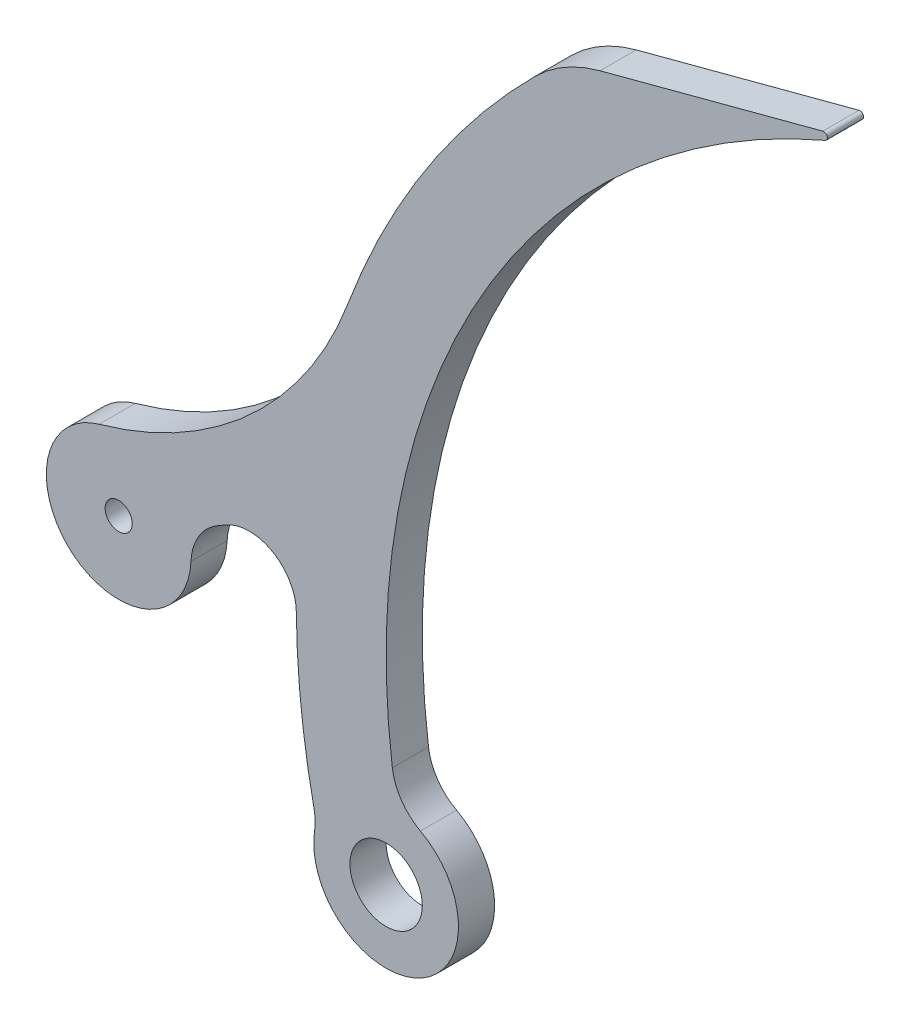
ISO-10303-21;
HEADER;
FILE_DESCRIPTION(('STEP AP214'),'2;1');
FILE_NAME('part.step','',(''),(''),'','','');
FILE_SCHEMA(('AUTOMOTIVE_DESIGN { 1 0 10303 214 1 1 1 1 }'));
ENDSEC;
DATA;
#1=APPLICATION_CONTEXT('core data for automotive mechanical design processes');
#2=APPLICATION_PROTOCOL_DEFINITION('international standard','automotive_design',2000,#1);
#3=PRODUCT_CONTEXT('',#1,'mechanical');
#4=PRODUCT('Part','Part','',(#3));
#5=PRODUCT_RELATED_PRODUCT_CATEGORY('part','',(#4));
#6=PRODUCT_DEFINITION_FORMATION('','',#4);
#7=PRODUCT_DEFINITION_CONTEXT('part definition',#1,'design');
#8=PRODUCT_DEFINITION('design','',#6,#7);
#9=PRODUCT_DEFINITION_SHAPE('','',#8);
#10=(LENGTH_UNIT() NAMED_UNIT(*) SI_UNIT(.MILLI.,.METRE.));
#11=(NAMED_UNIT(*) PLANE_ANGLE_UNIT() SI_UNIT($,.RADIAN.));
#12=(NAMED_UNIT(*) SI_UNIT($,.STERADIAN.) SOLID_ANGLE_UNIT());
#13=UNCERTAINTY_MEASURE_WITH_UNIT(LENGTH_MEASURE(1.E-05),#10,'distance_accuracy_value','');
#14=(GEOMETRIC_REPRESENTATION_CONTEXT(3) GLOBAL_UNCERTAINTY_ASSIGNED_CONTEXT((#13)) GLOBAL_UNIT_ASSIGNED_CONTEXT((#10,
#11,#12)) REPRESENTATION_CONTEXT('',''));
#15=CARTESIAN_POINT('',(0.,0.,0.));
#16=DIRECTION('',(0.,0.,1.));
#17=DIRECTION('',(1.,0.,0.));
#18=AXIS2_PLACEMENT_3D('',#15,#16,#17);
#19=CARTESIAN_POINT('',(-109.260328759457,258.812898886202,12.7));
#20=DIRECTION('',(0.,0.,-1.));
#21=DIRECTION('',(-1.,0.,0.));
#22=AXIS2_PLACEMENT_3D('',#19,#20,#21);
#23=PLANE('',#22);
#24=CARTESIAN_POINT('',(-262.922494984712,-45.7605384041366,12.7));
#25=DIRECTION('',(0.,0.,1.));
#26=DIRECTION('',(1.,0.,0.));
#27=AXIS2_PLACEMENT_3D('',#24,#25,#26);
#28=CIRCLE('',#27,12.7);
#29=CARTESIAN_POINT('',(-250.222494984712,-45.7605384041366,12.7));
#30=VERTEX_POINT('',#29);
#31=EDGE_CURVE('E172',#30,#30,#28,.T.);
#32=ORIENTED_EDGE('',*,*,#31,.F.);
#33=EDGE_LOOP('',(#32));
#34=FACE_BOUND('',#33,.T.);
#35=CARTESIAN_POINT('',(-109.260328759457,258.812898886202,12.7));
#36=DIRECTION('',(0.,0.,1.));
#37=DIRECTION('',(-1.,0.,0.));
#38=AXIS2_PLACEMENT_3D('',#35,#36,#37);
#39=CIRCLE('',#38,1.26999999999998);
#40=CARTESIAN_POINT('',(-108.761135556598,257.645120591225,12.7));
#41=VERTEX_POINT('',#40);
#42=CARTESIAN_POINT('',(-109.585986317079,260.040435914224,12.7));
#43=VERTEX_POINT('',#42);
#44=EDGE_CURVE('E195',#41,#43,#39,.T.);
#45=ORIENTED_EDGE('',*,*,#44,.T.);
#46=DIRECTION('',(-0.966564588993376,-0.256423273717627,0.));
#47=VECTOR('',#46,1.);
#48=CARTESIAN_POINT('',(-187.814837627455,239.286832502095,12.7));
#49=LINE('',#48,#47);
#50=CARTESIAN_POINT('',(-187.814837627455,239.286832502095,12.7));
#51=VERTEX_POINT('',#50);
#52=EDGE_CURVE('E113',#43,#51,#49,.T.);
#53=ORIENTED_EDGE('',*,*,#52,.T.);
#54=CARTESIAN_POINT('',(-174.788535322599,190.185351381231,12.7));
#55=DIRECTION('',(0.,0.,1.));
#56=DIRECTION('',(-1.,0.,0.));
#57=AXIS2_PLACEMENT_3D('',#54,#55,#56);
#58=CIRCLE('',#57,50.8000000000001);
#59=CARTESIAN_POINT('',(-210.684679592418,226.131238858944,12.7));
#60=VERTEX_POINT('',#59);
#61=EDGE_CURVE('E228',#51,#60,#58,.T.);
#62=ORIENTED_EDGE('',*,*,#61,.T.);
#63=CARTESIAN_POINT('',(-8.92249498471215,24.0894615958634,12.7));
#64=DIRECTION('',(0.,0.,1.));
#65=DIRECTION('',(1.,0.,0.));
#66=AXIS2_PLACEMENT_3D('',#63,#64,#65);
#67=CIRCLE('',#66,285.532588152908);
#68=CARTESIAN_POINT('',(-276.366612209981,124.101976107272,12.7));
#69=VERTEX_POINT('',#68);
#70=EDGE_CURVE('E247',#60,#69,#67,.T.);
#71=ORIENTED_EDGE('',*,*,#70,.T.);
#72=CARTESIAN_POINT('',(-399.008691384775,169.964801023502,12.7));
#73=DIRECTION('',(0.,0.,-1.));
#74=DIRECTION('',(1.,0.,0.));
#75=AXIS2_PLACEMENT_3D('',#72,#73,#74);
#76=CIRCLE('',#75,130.936924866949);
#77=CARTESIAN_POINT('',(-363.664476837649,43.8883766148923,12.7));
#78=VERTEX_POINT('',#77);
#79=EDGE_CURVE('E244',#69,#78,#76,.T.);
#80=ORIENTED_EDGE('',*,*,#79,.T.);
#81=CARTESIAN_POINT('',(-356.808175222125,19.4312482438643,12.7));
#82=DIRECTION('',(0.,0.,1.));
#83=DIRECTION('',(1.,0.,0.));
#84=AXIS2_PLACEMENT_3D('',#81,#82,#83);
#85=CIRCLE('',#84,25.4);
#86=CARTESIAN_POINT('',(-331.433346202008,18.3007385358963,12.7));
#87=VERTEX_POINT('',#86);
#88=EDGE_CURVE('E246',#78,#87,#85,.T.);
#89=ORIENTED_EDGE('',*,*,#88,.T.);
#90=CARTESIAN_POINT('',(-312.402224436919,17.4528562549199,12.7));
#91=DIRECTION('',(0.,0.,-1.));
#92=DIRECTION('',(1.,0.,0.));
#93=AXIS2_PLACEMENT_3D('',#90,#91,#92);
#94=CIRCLE('',#93,19.0500000000008);
#95=CARTESIAN_POINT('',(-321.809158258288,34.0182447526406,12.7));
#96=VERTEX_POINT('',#95);
#97=EDGE_CURVE('E249',#87,#96,#94,.T.);
#98=ORIENTED_EDGE('',*,*,#97,.T.);
#99=CARTESIAN_POINT('',(-399.008691384775,169.964801023502,12.7));
#100=DIRECTION('',(0.,0.,1.));
#101=DIRECTION('',(1.,0.,0.));
#102=AXIS2_PLACEMENT_3D('',#99,#100,#101);
#103=CIRCLE('',#102,156.336924866949);
#104=CARTESIAN_POINT('',(-319.362594724367,35.4369847042924,12.7));
#105=VERTEX_POINT('',#104);
#106=EDGE_CURVE('E255',#96,#105,#103,.T.);
#107=ORIENTED_EDGE('',*,*,#106,.T.);
#108=CARTESIAN_POINT('',(-310.951548792752,21.2301410598975,12.7));
#109=DIRECTION('',(0.,0.,-1.));
#110=DIRECTION('',(1.,0.,0.));
#111=AXIS2_PLACEMENT_3D('',#108,#109,#110);
#112=CIRCLE('',#111,16.5100000000003);
#113=CARTESIAN_POINT('',(-294.442288595821,21.3864348538876,12.7));
#114=VERTEX_POINT('',#113);
#115=EDGE_CURVE('E257',#105,#114,#112,.T.);
#116=ORIENTED_EDGE('',*,*,#115,.T.);
#117=CARTESIAN_POINT('',(-8.92249498471215,24.0894615958634,12.7));
#118=DIRECTION('',(0.,0.,1.));
#119=DIRECTION('',(1.,0.,0.));
#120=AXIS2_PLACEMENT_3D('',#117,#118,#119);
#121=CIRCLE('',#120,285.532588152908);
#122=CARTESIAN_POINT('',(-288.238569153544,-35.1675178091794,12.7));
#123=VERTEX_POINT('',#122);
#124=EDGE_CURVE('E259',#114,#123,#121,.T.);
#125=ORIENTED_EDGE('',*,*,#124,.T.);
#126=CARTESIAN_POINT('',(-306.873819327043,-39.1209910885999,12.7));
#127=DIRECTION('',(0.,0.,-1.));
#128=DIRECTION('',(1.,0.,0.));
#129=AXIS2_PLACEMENT_3D('',#126,#127,#128);
#130=CIRCLE('',#129,19.0499999999997);
#131=CARTESIAN_POINT('',(-288.037537466045,-41.9665113666863,12.7));
#132=VERTEX_POINT('',#131);
#133=EDGE_CURVE('E150',#123,#132,#130,.T.);
#134=ORIENTED_EDGE('',*,*,#133,.T.);
#135=CARTESIAN_POINT('',(-262.922494984712,-45.7605384041366,12.7));
#136=DIRECTION('',(0.,0.,1.));
#137=DIRECTION('',(1.,0.,0.));
#138=AXIS2_PLACEMENT_3D('',#135,#136,#137);
#139=CIRCLE('',#138,25.4000000000006);
#140=CARTESIAN_POINT('',(-250.885068445253,-23.3940375086647,12.7));
#141=VERTEX_POINT('',#140);
#142=EDGE_CURVE('E144',#132,#141,#139,.T.);
#143=ORIENTED_EDGE('',*,*,#142,.T.);
#144=CARTESIAN_POINT('',(-241.856998540658,-6.61916183706124,12.7));
#145=DIRECTION('',(0.,0.,-1.));
#146=DIRECTION('',(-1.,0.,0.));
#147=AXIS2_PLACEMENT_3D('',#144,#145,#146);
#148=CIRCLE('',#147,19.0500000000003);
#149=CARTESIAN_POINT('',(-260.743579910059,-9.10905022351537,12.7));
#150=VERTEX_POINT('',#149);
#151=EDGE_CURVE('E148',#141,#150,#148,.T.);
#152=ORIENTED_EDGE('',*,*,#151,.T.);
#153=CARTESIAN_POINT('',(-8.92249498471215,24.0894615958634,12.7));
#154=DIRECTION('',(0.,0.,-1.));
#155=DIRECTION('',(1.,0.,0.));
#156=AXIS2_PLACEMENT_3D('',#153,#154,#155);
#157=CIRCLE('',#156,254.);
#158=EDGE_CURVE('E52',#150,#41,#157,.T.);
#159=ORIENTED_EDGE('',*,*,#158,.T.);
#160=EDGE_LOOP('',(#45,#53,#62,#71,#80,#89,#98,#107,#116,#125,#134,#143,#152,#159));
#161=FACE_BOUND('',#160,.T.);
#162=CARTESIAN_POINT('',(-356.808175222125,19.4312482438643,12.7));
#163=DIRECTION('',(0.,0.,1.));
#164=DIRECTION('',(1.,0.,0.));
#165=AXIS2_PLACEMENT_3D('',#162,#163,#164);
#166=CIRCLE('',#165,4.76250000000001);
#167=CARTESIAN_POINT('',(-352.045675222125,19.4312482438643,12.7));
#168=VERTEX_POINT('',#167);
#169=EDGE_CURVE('E302',#168,#168,#166,.T.);
#170=ORIENTED_EDGE('',*,*,#169,.F.);
#171=EDGE_LOOP('',(#170));
#172=FACE_BOUND('',#171,.T.);
#173=ADVANCED_FACE('F35',(#34,#161,#172),#23,.F.);
#174=CARTESIAN_POINT('',(-109.260328759457,258.812898886202,0.));
#175=DIRECTION('',(0.,0.,-1.));
#176=DIRECTION('',(-1.,0.,0.));
#177=AXIS2_PLACEMENT_3D('',#174,#175,#176);
#178=PLANE('',#177);
#179=CARTESIAN_POINT('',(-262.922494984712,-45.7605384041366,0.));
#180=DIRECTION('',(0.,0.,1.));
#181=DIRECTION('',(1.,0.,0.));
#182=AXIS2_PLACEMENT_3D('',#179,#180,#181);
#183=CIRCLE('',#182,12.7);
#184=CARTESIAN_POINT('',(-250.222494984712,-45.7605384041366,0.));
#185=VERTEX_POINT('',#184);
#186=EDGE_CURVE('E307',#185,#185,#183,.T.);
#187=ORIENTED_EDGE('',*,*,#186,.T.);
#188=EDGE_LOOP('',(#187));
#189=FACE_BOUND('',#188,.T.);
#190=CARTESIAN_POINT('',(-109.260328759457,258.812898886202,0.));
#191=DIRECTION('',(0.,0.,1.));
#192=DIRECTION('',(-1.,0.,0.));
#193=AXIS2_PLACEMENT_3D('',#190,#191,#192);
#194=CIRCLE('',#193,1.26999999999998);
#195=CARTESIAN_POINT('',(-108.761135556598,257.645120591225,0.));
#196=VERTEX_POINT('',#195);
#197=CARTESIAN_POINT('',(-109.585986317079,260.040435914224,0.));
#198=VERTEX_POINT('',#197);
#199=EDGE_CURVE('E168',#196,#198,#194,.T.);
#200=ORIENTED_EDGE('',*,*,#199,.F.);
#201=CARTESIAN_POINT('',(-8.92249498471215,24.0894615958634,0.));
#202=DIRECTION('',(0.,0.,-1.));
#203=DIRECTION('',(1.,0.,0.));
#204=AXIS2_PLACEMENT_3D('',#201,#202,#203);
#205=CIRCLE('',#204,254.);
#206=CARTESIAN_POINT('',(-260.743579910059,-9.10905022351537,0.));
#207=VERTEX_POINT('',#206);
#208=EDGE_CURVE('E105',#207,#196,#205,.T.);
#209=ORIENTED_EDGE('',*,*,#208,.F.);
#210=CARTESIAN_POINT('',(-241.856998540658,-6.61916183706124,0.));
#211=DIRECTION('',(0.,0.,-1.));
#212=DIRECTION('',(-1.,0.,0.));
#213=AXIS2_PLACEMENT_3D('',#210,#211,#212);
#214=CIRCLE('',#213,19.0500000000003);
#215=CARTESIAN_POINT('',(-250.885068445253,-23.3940375086647,0.));
#216=VERTEX_POINT('',#215);
#217=EDGE_CURVE('E99',#216,#207,#214,.T.);
#218=ORIENTED_EDGE('',*,*,#217,.F.);
#219=CARTESIAN_POINT('',(-262.922494984712,-45.7605384041366,0.));
#220=DIRECTION('',(0.,0.,1.));
#221=DIRECTION('',(1.,0.,0.));
#222=AXIS2_PLACEMENT_3D('',#219,#220,#221);
#223=CIRCLE('',#222,25.4000000000006);
#224=CARTESIAN_POINT('',(-288.037537466045,-41.9665113666863,0.));
#225=VERTEX_POINT('',#224);
#226=EDGE_CURVE('E158',#225,#216,#223,.T.);
#227=ORIENTED_EDGE('',*,*,#226,.F.);
#228=CARTESIAN_POINT('',(-306.873819327043,-39.1209910885999,0.));
#229=DIRECTION('',(0.,0.,-1.));
#230=DIRECTION('',(1.,0.,0.));
#231=AXIS2_PLACEMENT_3D('',#228,#229,#230);
#232=CIRCLE('',#231,19.0499999999997);
#233=CARTESIAN_POINT('',(-288.238569153544,-35.1675178091794,0.));
#234=VERTEX_POINT('',#233);
#235=EDGE_CURVE('E190',#234,#225,#232,.T.);
#236=ORIENTED_EDGE('',*,*,#235,.F.);
#237=CARTESIAN_POINT('',(-8.92249498471215,24.0894615958634,0.));
#238=DIRECTION('',(0.,0.,1.));
#239=DIRECTION('',(1.,0.,0.));
#240=AXIS2_PLACEMENT_3D('',#237,#238,#239);
#241=CIRCLE('',#240,285.532588152908);
#242=CARTESIAN_POINT('',(-294.442288595821,21.3864348538876,0.));
#243=VERTEX_POINT('',#242);
#244=EDGE_CURVE('E188',#243,#234,#241,.T.);
#245=ORIENTED_EDGE('',*,*,#244,.F.);
#246=CARTESIAN_POINT('',(-310.951548792752,21.2301410598975,0.));
#247=DIRECTION('',(0.,0.,-1.));
#248=DIRECTION('',(1.,0.,0.));
#249=AXIS2_PLACEMENT_3D('',#246,#247,#248);
#250=CIRCLE('',#249,16.5100000000003);
#251=CARTESIAN_POINT('',(-319.362594724367,35.4369847042924,0.));
#252=VERTEX_POINT('',#251);
#253=EDGE_CURVE('E186',#252,#243,#250,.T.);
#254=ORIENTED_EDGE('',*,*,#253,.F.);
#255=CARTESIAN_POINT('',(-399.008691384775,169.964801023502,0.));
#256=DIRECTION('',(0.,0.,1.));
#257=DIRECTION('',(1.,0.,0.));
#258=AXIS2_PLACEMENT_3D('',#255,#256,#257);
#259=CIRCLE('',#258,156.336924866949);
#260=CARTESIAN_POINT('',(-321.809158258288,34.0182447526406,0.));
#261=VERTEX_POINT('',#260);
#262=EDGE_CURVE('E184',#261,#252,#259,.T.);
#263=ORIENTED_EDGE('',*,*,#262,.F.);
#264=CARTESIAN_POINT('',(-312.402224436919,17.4528562549199,0.));
#265=DIRECTION('',(0.,0.,-1.));
#266=DIRECTION('',(1.,0.,0.));
#267=AXIS2_PLACEMENT_3D('',#264,#265,#266);
#268=CIRCLE('',#267,19.0500000000008);
#269=CARTESIAN_POINT('',(-331.433346202008,18.3007385358963,0.));
#270=VERTEX_POINT('',#269);
#271=EDGE_CURVE('E182',#270,#261,#268,.T.);
#272=ORIENTED_EDGE('',*,*,#271,.F.);
#273=CARTESIAN_POINT('',(-356.808175222125,19.4312482438643,0.));
#274=DIRECTION('',(0.,0.,1.));
#275=DIRECTION('',(1.,0.,0.));
#276=AXIS2_PLACEMENT_3D('',#273,#274,#275);
#277=CIRCLE('',#276,25.4);
#278=CARTESIAN_POINT('',(-363.664476837649,43.8883766148923,0.));
#279=VERTEX_POINT('',#278);
#280=EDGE_CURVE('E180',#279,#270,#277,.T.);
#281=ORIENTED_EDGE('',*,*,#280,.F.);
#282=CARTESIAN_POINT('',(-399.008691384775,169.964801023502,0.));
#283=DIRECTION('',(0.,0.,-1.));
#284=DIRECTION('',(1.,0.,0.));
#285=AXIS2_PLACEMENT_3D('',#282,#283,#284);
#286=CIRCLE('',#285,130.936924866949);
#287=CARTESIAN_POINT('',(-276.366612209981,124.101976107272,0.));
#288=VERTEX_POINT('',#287);
#289=EDGE_CURVE('E178',#288,#279,#286,.T.);
#290=ORIENTED_EDGE('',*,*,#289,.F.);
#291=CARTESIAN_POINT('',(-8.92249498471215,24.0894615958634,0.));
#292=DIRECTION('',(0.,0.,1.));
#293=DIRECTION('',(1.,0.,0.));
#294=AXIS2_PLACEMENT_3D('',#291,#292,#293);
#295=CIRCLE('',#294,285.532588152908);
#296=CARTESIAN_POINT('',(-210.684679592418,226.131238858944,0.));
#297=VERTEX_POINT('',#296);
#298=EDGE_CURVE('E176',#297,#288,#295,.T.);
#299=ORIENTED_EDGE('',*,*,#298,.F.);
#300=CARTESIAN_POINT('',(-174.788535322599,190.185351381231,0.));
#301=DIRECTION('',(0.,0.,1.));
#302=DIRECTION('',(-1.,0.,0.));
#303=AXIS2_PLACEMENT_3D('',#300,#301,#302);
#304=CIRCLE('',#303,50.8000000000001);
#305=CARTESIAN_POINT('',(-187.814837627455,239.286832502095,0.));
#306=VERTEX_POINT('',#305);
#307=EDGE_CURVE('E174',#306,#297,#304,.T.);
#308=ORIENTED_EDGE('',*,*,#307,.F.);
#309=DIRECTION('',(-0.966564588993376,-0.256423273717627,0.));
#310=VECTOR('',#309,1.);
#311=CARTESIAN_POINT('',(-187.814837627455,239.286832502095,0.));
#312=LINE('',#311,#310);
#313=EDGE_CURVE('E171',#198,#306,#312,.T.);
#314=ORIENTED_EDGE('',*,*,#313,.F.);
#315=EDGE_LOOP('',(#200,#209,#218,#227,#236,#245,#254,#263,#272,#281,#290,#299,#308,#314));
#316=FACE_BOUND('',#315,.T.);
#317=CARTESIAN_POINT('',(-356.808175222125,19.4312482438643,0.));
#318=DIRECTION('',(0.,0.,1.));
#319=DIRECTION('',(1.,0.,0.));
#320=AXIS2_PLACEMENT_3D('',#317,#318,#319);
#321=CIRCLE('',#320,4.76250000000001);
#322=CARTESIAN_POINT('',(-352.045675222125,19.4312482438643,0.));
#323=VERTEX_POINT('',#322);
#324=EDGE_CURVE('E305',#323,#323,#321,.T.);
#325=ORIENTED_EDGE('',*,*,#324,.T.);
#326=EDGE_LOOP('',(#325));
#327=FACE_BOUND('',#326,.T.);
#328=ADVANCED_FACE('F232',(#189,#316,#327),#178,.T.);
#329=CARTESIAN_POINT('',(-109.260328759457,258.812898886202,12.7));
#330=DIRECTION('',(0.,0.,-1.));
#331=DIRECTION('',(-1.,0.,0.));
#332=AXIS2_PLACEMENT_3D('',#329,#330,#331);
#333=CYLINDRICAL_SURFACE('',#332,1.26999999999998);
#334=ORIENTED_EDGE('',*,*,#199,.T.);
#335=DIRECTION('',(0.,0.,-1.));
#336=VECTOR('',#335,1.);
#337=CARTESIAN_POINT('',(-109.585986317079,260.040435914224,12.7));
#338=LINE('',#337,#336);
#339=EDGE_CURVE('E11',#43,#198,#338,.T.);
#340=ORIENTED_EDGE('',*,*,#339,.F.);
#341=ORIENTED_EDGE('',*,*,#44,.F.);
#342=DIRECTION('',(0.,0.,-1.));
#343=VECTOR('',#342,1.);
#344=CARTESIAN_POINT('',(-108.761135556598,257.645120591225,12.7));
#345=LINE('',#344,#343);
#346=EDGE_CURVE('E164',#41,#196,#345,.T.);
#347=ORIENTED_EDGE('',*,*,#346,.T.);
#348=EDGE_LOOP('',(#334,#340,#341,#347));
#349=FACE_BOUND('',#348,.T.);
#350=ADVANCED_FACE('F37',(#349),#333,.T.);
#351=CARTESIAN_POINT('',(-187.814837627455,239.286832502095,12.7));
#352=DIRECTION('',(0.256423273717627,-0.966564588993376,0.));
#353=DIRECTION('',(0.966564588993376,0.256423273717627,0.));
#354=AXIS2_PLACEMENT_3D('',#351,#352,#353);
#355=PLANE('',#354);
#356=ORIENTED_EDGE('',*,*,#313,.T.);
#357=DIRECTION('',(0.,0.,-1.));
#358=VECTOR('',#357,1.);
#359=CARTESIAN_POINT('',(-187.814837627455,239.286832502095,12.7));
#360=LINE('',#359,#358);
#361=EDGE_CURVE('E44',#51,#306,#360,.T.);
#362=ORIENTED_EDGE('',*,*,#361,.F.);
#363=ORIENTED_EDGE('',*,*,#52,.F.);
#364=ORIENTED_EDGE('',*,*,#339,.T.);
#365=EDGE_LOOP('',(#356,#362,#363,#364));
#366=FACE_BOUND('',#365,.T.);
#367=ADVANCED_FACE('F420',(#366),#355,.F.);
#368=CARTESIAN_POINT('',(-174.788535322599,190.185351381231,12.7));
#369=DIRECTION('',(0.,0.,-1.));
#370=DIRECTION('',(-1.,0.,0.));
#371=AXIS2_PLACEMENT_3D('',#368,#369,#370);
#372=CYLINDRICAL_SURFACE('',#371,50.8000000000001);
#373=ORIENTED_EDGE('',*,*,#307,.T.);
#374=DIRECTION('',(0.,0.,-1.));
#375=VECTOR('',#374,1.);
#376=CARTESIAN_POINT('',(-210.684679592418,226.131238858944,12.7));
#377=LINE('',#376,#375);
#378=EDGE_CURVE('E220',#60,#297,#377,.T.);
#379=ORIENTED_EDGE('',*,*,#378,.F.);
#380=ORIENTED_EDGE('',*,*,#61,.F.);
#381=ORIENTED_EDGE('',*,*,#361,.T.);
#382=EDGE_LOOP('',(#373,#379,#380,#381));
#383=FACE_BOUND('',#382,.T.);
#384=ADVANCED_FACE('F226',(#383),#372,.T.);
#385=CARTESIAN_POINT('',(-8.92249498471215,24.0894615958634,12.7));
#386=DIRECTION('',(0.,0.,-1.));
#387=DIRECTION('',(-1.,0.,0.));
#388=AXIS2_PLACEMENT_3D('',#385,#386,#387);
#389=CYLINDRICAL_SURFACE('',#388,285.532588152908);
#390=ORIENTED_EDGE('',*,*,#298,.T.);
#391=DIRECTION('',(0.,0.,-1.));
#392=VECTOR('',#391,1.);
#393=CARTESIAN_POINT('',(-276.366612209981,124.101976107272,12.7));
#394=LINE('',#393,#392);
#395=EDGE_CURVE('E217',#69,#288,#394,.T.);
#396=ORIENTED_EDGE('',*,*,#395,.F.);
#397=ORIENTED_EDGE('',*,*,#70,.F.);
#398=ORIENTED_EDGE('',*,*,#378,.T.);
#399=EDGE_LOOP('',(#390,#396,#397,#398));
#400=FACE_BOUND('',#399,.T.);
#401=ADVANCED_FACE('F238',(#400),#389,.T.);
#402=CARTESIAN_POINT('',(-399.008691384775,169.964801023502,12.7));
#403=DIRECTION('',(0.,0.,-1.));
#404=DIRECTION('',(-1.,0.,0.));
#405=AXIS2_PLACEMENT_3D('',#402,#403,#404);
#406=CYLINDRICAL_SURFACE('',#405,130.936924866949);
#407=ORIENTED_EDGE('',*,*,#289,.T.);
#408=DIRECTION('',(0.,0.,-1.));
#409=VECTOR('',#408,1.);
#410=CARTESIAN_POINT('',(-363.664476837649,43.8883766148923,12.7));
#411=LINE('',#410,#409);
#412=EDGE_CURVE('E214',#78,#279,#411,.T.);
#413=ORIENTED_EDGE('',*,*,#412,.F.);
#414=ORIENTED_EDGE('',*,*,#79,.F.);
#415=ORIENTED_EDGE('',*,*,#395,.T.);
#416=EDGE_LOOP('',(#407,#413,#414,#415));
#417=FACE_BOUND('',#416,.T.);
#418=ADVANCED_FACE('F242',(#417),#406,.F.);
#419=CARTESIAN_POINT('',(-356.808175222125,19.4312482438643,12.7));
#420=DIRECTION('',(0.,0.,-1.));
#421=DIRECTION('',(-1.,0.,0.));
#422=AXIS2_PLACEMENT_3D('',#419,#420,#421);
#423=CYLINDRICAL_SURFACE('',#422,25.4);
#424=ORIENTED_EDGE('',*,*,#280,.T.);
#425=DIRECTION('',(0.,0.,-1.));
#426=VECTOR('',#425,1.);
#427=CARTESIAN_POINT('',(-331.433346202008,18.3007385358963,12.7));
#428=LINE('',#427,#426);
#429=EDGE_CURVE('E211',#87,#270,#428,.T.);
#430=ORIENTED_EDGE('',*,*,#429,.F.);
#431=ORIENTED_EDGE('',*,*,#88,.F.);
#432=ORIENTED_EDGE('',*,*,#412,.T.);
#433=EDGE_LOOP('',(#424,#430,#431,#432));
#434=FACE_BOUND('',#433,.T.);
#435=ADVANCED_FACE('F385',(#434),#423,.T.);
#436=CARTESIAN_POINT('',(-312.402224436919,17.4528562549199,12.7));
#437=DIRECTION('',(0.,0.,-1.));
#438=DIRECTION('',(-1.,0.,0.));
#439=AXIS2_PLACEMENT_3D('',#436,#437,#438);
#440=CYLINDRICAL_SURFACE('',#439,19.0500000000008);
#441=ORIENTED_EDGE('',*,*,#271,.T.);
#442=DIRECTION('',(0.,0.,-1.));
#443=VECTOR('',#442,1.);
#444=CARTESIAN_POINT('',(-321.809158258288,34.0182447526406,12.7));
#445=LINE('',#444,#443);
#446=EDGE_CURVE('E208',#96,#261,#445,.T.);
#447=ORIENTED_EDGE('',*,*,#446,.F.);
#448=ORIENTED_EDGE('',*,*,#97,.F.);
#449=ORIENTED_EDGE('',*,*,#429,.T.);
#450=EDGE_LOOP('',(#441,#447,#448,#449));
#451=FACE_BOUND('',#450,.T.);
#452=ADVANCED_FACE('F375',(#451),#440,.F.);
#453=CARTESIAN_POINT('',(-399.008691384775,169.964801023502,12.7));
#454=DIRECTION('',(0.,0.,-1.));
#455=DIRECTION('',(-1.,0.,0.));
#456=AXIS2_PLACEMENT_3D('',#453,#454,#455);
#457=CYLINDRICAL_SURFACE('',#456,156.336924866949);
#458=ORIENTED_EDGE('',*,*,#262,.T.);
#459=DIRECTION('',(0.,0.,-1.));
#460=VECTOR('',#459,1.);
#461=CARTESIAN_POINT('',(-319.362594724367,35.4369847042924,12.7));
#462=LINE('',#461,#460);
#463=EDGE_CURVE('E205',#105,#252,#462,.T.);
#464=ORIENTED_EDGE('',*,*,#463,.F.);
#465=ORIENTED_EDGE('',*,*,#106,.F.);
#466=ORIENTED_EDGE('',*,*,#446,.T.);
#467=EDGE_LOOP('',(#458,#464,#465,#466));
#468=FACE_BOUND('',#467,.T.);
#469=ADVANCED_FACE('F365',(#468),#457,.T.);
#470=CARTESIAN_POINT('',(-310.951548792752,21.2301410598975,12.7));
#471=DIRECTION('',(0.,0.,-1.));
#472=DIRECTION('',(-1.,0.,0.));
#473=AXIS2_PLACEMENT_3D('',#470,#471,#472);
#474=CYLINDRICAL_SURFACE('',#473,16.5100000000003);
#475=ORIENTED_EDGE('',*,*,#253,.T.);
#476=DIRECTION('',(0.,0.,-1.));
#477=VECTOR('',#476,1.);
#478=CARTESIAN_POINT('',(-294.442288595821,21.3864348538876,12.7));
#479=LINE('',#478,#477);
#480=EDGE_CURVE('E202',#114,#243,#479,.T.);
#481=ORIENTED_EDGE('',*,*,#480,.F.);
#482=ORIENTED_EDGE('',*,*,#115,.F.);
#483=ORIENTED_EDGE('',*,*,#463,.T.);
#484=EDGE_LOOP('',(#475,#481,#482,#483));
#485=FACE_BOUND('',#484,.T.);
#486=ADVANCED_FACE('F356',(#485),#474,.F.);
#487=CARTESIAN_POINT('',(-8.92249498471215,24.0894615958634,12.7));
#488=DIRECTION('',(0.,0.,-1.));
#489=DIRECTION('',(-1.,0.,0.));
#490=AXIS2_PLACEMENT_3D('',#487,#488,#489);
#491=CYLINDRICAL_SURFACE('',#490,285.532588152908);
#492=ORIENTED_EDGE('',*,*,#244,.T.);
#493=DIRECTION('',(0.,0.,-1.));
#494=VECTOR('',#493,1.);
#495=CARTESIAN_POINT('',(-288.238569153544,-35.1675178091794,12.7));
#496=LINE('',#495,#494);
#497=EDGE_CURVE('E199',#123,#234,#496,.T.);
#498=ORIENTED_EDGE('',*,*,#497,.F.);
#499=ORIENTED_EDGE('',*,*,#124,.F.);
#500=ORIENTED_EDGE('',*,*,#480,.T.);
#501=EDGE_LOOP('',(#492,#498,#499,#500));
#502=FACE_BOUND('',#501,.T.);
#503=ADVANCED_FACE('F265',(#502),#491,.T.);
#504=CARTESIAN_POINT('',(-306.873819327043,-39.1209910885999,12.7));
#505=DIRECTION('',(0.,0.,-1.));
#506=DIRECTION('',(-1.,0.,0.));
#507=AXIS2_PLACEMENT_3D('',#504,#505,#506);
#508=CYLINDRICAL_SURFACE('',#507,19.0499999999997);
#509=ORIENTED_EDGE('',*,*,#235,.T.);
#510=DIRECTION('',(0.,0.,-1.));
#511=VECTOR('',#510,1.);
#512=CARTESIAN_POINT('',(-288.037537466045,-41.9665113666863,12.7));
#513=LINE('',#512,#511);
#514=EDGE_CURVE('E159',#132,#225,#513,.T.);
#515=ORIENTED_EDGE('',*,*,#514,.F.);
#516=ORIENTED_EDGE('',*,*,#133,.F.);
#517=ORIENTED_EDGE('',*,*,#497,.T.);
#518=EDGE_LOOP('',(#509,#515,#516,#517));
#519=FACE_BOUND('',#518,.T.);
#520=ADVANCED_FACE('F269',(#519),#508,.F.);
#521=CARTESIAN_POINT('',(-262.922494984712,-45.7605384041366,12.7));
#522=DIRECTION('',(0.,0.,-1.));
#523=DIRECTION('',(-1.,0.,0.));
#524=AXIS2_PLACEMENT_3D('',#521,#522,#523);
#525=CYLINDRICAL_SURFACE('',#524,25.4000000000006);
#526=ORIENTED_EDGE('',*,*,#226,.T.);
#527=DIRECTION('',(0.,0.,-1.));
#528=VECTOR('',#527,1.);
#529=CARTESIAN_POINT('',(-250.885068445253,-23.3940375086647,12.7));
#530=LINE('',#529,#528);
#531=EDGE_CURVE('E155',#141,#216,#530,.T.);
#532=ORIENTED_EDGE('',*,*,#531,.F.);
#533=ORIENTED_EDGE('',*,*,#142,.F.);
#534=ORIENTED_EDGE('',*,*,#514,.T.);
#535=EDGE_LOOP('',(#526,#532,#533,#534));
#536=FACE_BOUND('',#535,.T.);
#537=ADVANCED_FACE('F156',(#536),#525,.T.);
#538=CARTESIAN_POINT('',(-241.856998540658,-6.61916183706124,12.7));
#539=DIRECTION('',(0.,0.,-1.));
#540=DIRECTION('',(-1.,0.,0.));
#541=AXIS2_PLACEMENT_3D('',#538,#539,#540);
#542=CYLINDRICAL_SURFACE('',#541,19.0500000000003);
#543=ORIENTED_EDGE('',*,*,#217,.T.);
#544=DIRECTION('',(0.,0.,-1.));
#545=VECTOR('',#544,1.);
#546=CARTESIAN_POINT('',(-260.743579910059,-9.10905022351537,12.7));
#547=LINE('',#546,#545);
#548=EDGE_CURVE('E160',#150,#207,#547,.T.);
#549=ORIENTED_EDGE('',*,*,#548,.F.);
#550=ORIENTED_EDGE('',*,*,#151,.F.);
#551=ORIENTED_EDGE('',*,*,#531,.T.);
#552=EDGE_LOOP('',(#543,#549,#550,#551));
#553=FACE_BOUND('',#552,.T.);
#554=ADVANCED_FACE('F162',(#553),#542,.F.);
#555=CARTESIAN_POINT('',(-8.92249498471215,24.0894615958634,12.7));
#556=DIRECTION('',(0.,0.,-1.));
#557=DIRECTION('',(-1.,0.,0.));
#558=AXIS2_PLACEMENT_3D('',#555,#556,#557);
#559=CYLINDRICAL_SURFACE('',#558,254.);
#560=ORIENTED_EDGE('',*,*,#208,.T.);
#561=ORIENTED_EDGE('',*,*,#346,.F.);
#562=ORIENTED_EDGE('',*,*,#158,.F.);
#563=ORIENTED_EDGE('',*,*,#548,.T.);
#564=EDGE_LOOP('',(#560,#561,#562,#563));
#565=FACE_BOUND('',#564,.T.);
#566=ADVANCED_FACE('F273',(#565),#559,.F.);
#567=CARTESIAN_POINT('',(-262.922494984712,-45.7605384041366,12.7));
#568=DIRECTION('',(0.,0.,-1.));
#569=DIRECTION('',(-1.,0.,0.));
#570=AXIS2_PLACEMENT_3D('',#567,#568,#569);
#571=CYLINDRICAL_SURFACE('',#570,12.7);
#572=ORIENTED_EDGE('',*,*,#31,.T.);
#573=EDGE_LOOP('',(#572));
#574=FACE_BOUND('',#573,.T.);
#575=ORIENTED_EDGE('',*,*,#186,.F.);
#576=EDGE_LOOP('',(#575));
#577=FACE_BOUND('',#576,.T.);
#578=ADVANCED_FACE('F275',(#574,#577),#571,.F.);
#579=CARTESIAN_POINT('',(-356.808175222125,19.4312482438643,12.7));
#580=DIRECTION('',(0.,0.,-1.));
#581=DIRECTION('',(-1.,0.,0.));
#582=AXIS2_PLACEMENT_3D('',#579,#580,#581);
#583=CYLINDRICAL_SURFACE('',#582,4.76250000000001);
#584=ORIENTED_EDGE('',*,*,#169,.T.);
#585=EDGE_LOOP('',(#584));
#586=FACE_BOUND('',#585,.T.);
#587=ORIENTED_EDGE('',*,*,#324,.F.);
#588=EDGE_LOOP('',(#587));
#589=FACE_BOUND('',#588,.T.);
#590=ADVANCED_FACE('F281',(#586,#589),#583,.F.);
#591=CLOSED_SHELL('',(#173,#328,#350,#367,#384,#401,#418,#435,#452,#469,#486,#503,#520,#537,
#554,#566,#578,#590));
#592=MANIFOLD_SOLID_BREP('B2',#591);
#593=ADVANCED_BREP_SHAPE_REPRESENTATION('',(#18,#592),#14);
#594=SHAPE_DEFINITION_REPRESENTATION(#9,#593);
ENDSEC;
END-ISO-10303-21;
